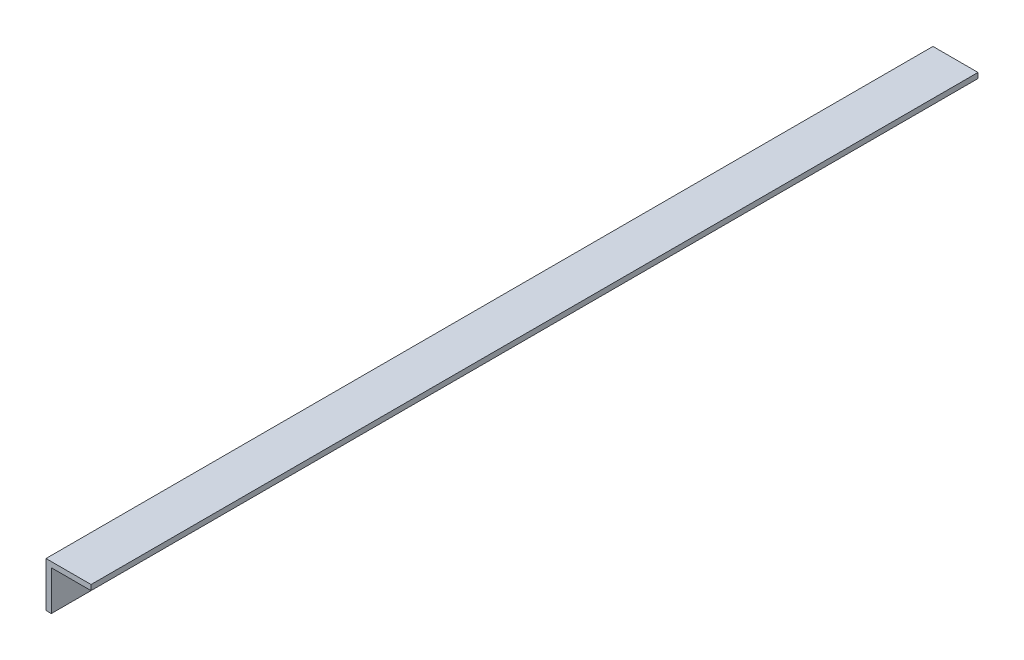
ISO-10303-21;
HEADER;
FILE_DESCRIPTION(('STEP AP214'),'2;1');
FILE_NAME('part.step','',(''),(''),'','','');
FILE_SCHEMA(('AUTOMOTIVE_DESIGN { 1 0 10303 214 1 1 1 1 }'));
ENDSEC;
DATA;
#1=APPLICATION_CONTEXT('core data for automotive mechanical design processes');
#2=APPLICATION_PROTOCOL_DEFINITION('international standard','automotive_design',2000,#1);
#3=PRODUCT_CONTEXT('',#1,'mechanical');
#4=PRODUCT('Part','Part','',(#3));
#5=PRODUCT_RELATED_PRODUCT_CATEGORY('part','',(#4));
#6=PRODUCT_DEFINITION_FORMATION('','',#4);
#7=PRODUCT_DEFINITION_CONTEXT('part definition',#1,'design');
#8=PRODUCT_DEFINITION('design','',#6,#7);
#9=PRODUCT_DEFINITION_SHAPE('','',#8);
#10=(LENGTH_UNIT() NAMED_UNIT(*) SI_UNIT(.MILLI.,.METRE.));
#11=(NAMED_UNIT(*) PLANE_ANGLE_UNIT() SI_UNIT($,.RADIAN.));
#12=(NAMED_UNIT(*) SI_UNIT($,.STERADIAN.) SOLID_ANGLE_UNIT());
#13=UNCERTAINTY_MEASURE_WITH_UNIT(LENGTH_MEASURE(1.E-05),#10,'distance_accuracy_value','');
#14=(GEOMETRIC_REPRESENTATION_CONTEXT(3) GLOBAL_UNCERTAINTY_ASSIGNED_CONTEXT((#13)) GLOBAL_UNIT_ASSIGNED_CONTEXT((#10,
#11,#12)) REPRESENTATION_CONTEXT('',''));
#15=CARTESIAN_POINT('',(0.,0.,0.));
#16=DIRECTION('',(0.,0.,1.));
#17=DIRECTION('',(1.,0.,0.));
#18=AXIS2_PLACEMENT_3D('',#15,#16,#17);
#19=CARTESIAN_POINT('',(0.,0.,500.));
#20=DIRECTION('',(0.,-1.,0.));
#21=DIRECTION('',(0.,0.,-1.));
#22=AXIS2_PLACEMENT_3D('',#19,#20,#21);
#23=PLANE('',#22);
#24=DIRECTION('',(-1.,0.,0.));
#25=VECTOR('',#24,1.);
#26=CARTESIAN_POINT('',(0.,0.,0.));
#27=LINE('',#26,#25);
#28=CARTESIAN_POINT('',(25.4,0.,0.));
#29=VERTEX_POINT('',#28);
#30=CARTESIAN_POINT('',(0.,0.,0.));
#31=VERTEX_POINT('',#30);
#32=EDGE_CURVE('E134',#29,#31,#27,.T.);
#33=ORIENTED_EDGE('',*,*,#32,.T.);
#34=DIRECTION('',(0.,0.,-1.));
#35=VECTOR('',#34,1.);
#36=CARTESIAN_POINT('',(0.,0.,500.));
#37=LINE('',#36,#35);
#38=CARTESIAN_POINT('',(0.,0.,500.));
#39=VERTEX_POINT('',#38);
#40=EDGE_CURVE('E11',#39,#31,#37,.T.);
#41=ORIENTED_EDGE('',*,*,#40,.F.);
#42=DIRECTION('',(-1.,0.,0.));
#43=VECTOR('',#42,1.);
#44=CARTESIAN_POINT('',(0.,0.,500.));
#45=LINE('',#44,#43);
#46=CARTESIAN_POINT('',(25.4,0.,500.));
#47=VERTEX_POINT('',#46);
#48=EDGE_CURVE('E150',#47,#39,#45,.T.);
#49=ORIENTED_EDGE('',*,*,#48,.F.);
#50=DIRECTION('',(0.,0.,-1.));
#51=VECTOR('',#50,1.);
#52=CARTESIAN_POINT('',(25.4,0.,500.));
#53=LINE('',#52,#51);
#54=EDGE_CURVE('E130',#47,#29,#53,.T.);
#55=ORIENTED_EDGE('',*,*,#54,.T.);
#56=EDGE_LOOP('',(#33,#41,#49,#55));
#57=FACE_BOUND('',#56,.T.);
#58=ADVANCED_FACE('F45',(#57),#23,.F.);
#59=CARTESIAN_POINT('',(0.,0.,500.));
#60=DIRECTION('',(1.,0.,0.));
#61=DIRECTION('',(0.,0.,-1.));
#62=AXIS2_PLACEMENT_3D('',#59,#60,#61);
#63=PLANE('',#62);
#64=DIRECTION('',(0.,-1.,0.));
#65=VECTOR('',#64,1.);
#66=CARTESIAN_POINT('',(0.,0.,0.));
#67=LINE('',#66,#65);
#68=CARTESIAN_POINT('',(0.,-25.4,0.));
#69=VERTEX_POINT('',#68);
#70=EDGE_CURVE('E138',#31,#69,#67,.T.);
#71=ORIENTED_EDGE('',*,*,#70,.T.);
#72=DIRECTION('',(0.,0.,-1.));
#73=VECTOR('',#72,1.);
#74=CARTESIAN_POINT('',(0.,-25.4,500.));
#75=LINE('',#74,#73);
#76=CARTESIAN_POINT('',(0.,-25.4,500.));
#77=VERTEX_POINT('',#76);
#78=EDGE_CURVE('E54',#77,#69,#75,.T.);
#79=ORIENTED_EDGE('',*,*,#78,.F.);
#80=DIRECTION('',(0.,-1.,0.));
#81=VECTOR('',#80,1.);
#82=CARTESIAN_POINT('',(0.,0.,500.));
#83=LINE('',#82,#81);
#84=EDGE_CURVE('E99',#39,#77,#83,.T.);
#85=ORIENTED_EDGE('',*,*,#84,.F.);
#86=ORIENTED_EDGE('',*,*,#40,.T.);
#87=EDGE_LOOP('',(#71,#79,#85,#86));
#88=FACE_BOUND('',#87,.T.);
#89=ADVANCED_FACE('F178',(#88),#63,.F.);
#90=CARTESIAN_POINT('',(0.,-25.4,500.));
#91=DIRECTION('',(0.,1.,0.));
#92=DIRECTION('',(0.,0.,1.));
#93=AXIS2_PLACEMENT_3D('',#90,#91,#92);
#94=PLANE('',#93);
#95=DIRECTION('',(1.,0.,0.));
#96=VECTOR('',#95,1.);
#97=CARTESIAN_POINT('',(0.,-25.4,0.));
#98=LINE('',#97,#96);
#99=CARTESIAN_POINT('',(3.,-25.4,0.));
#100=VERTEX_POINT('',#99);
#101=EDGE_CURVE('E141',#69,#100,#98,.T.);
#102=ORIENTED_EDGE('',*,*,#101,.T.);
#103=DIRECTION('',(0.,0.,-1.));
#104=VECTOR('',#103,1.);
#105=CARTESIAN_POINT('',(3.,-25.4,500.));
#106=LINE('',#105,#104);
#107=CARTESIAN_POINT('',(3.,-25.4,500.));
#108=VERTEX_POINT('',#107);
#109=EDGE_CURVE('E123',#108,#100,#106,.T.);
#110=ORIENTED_EDGE('',*,*,#109,.F.);
#111=DIRECTION('',(1.,0.,0.));
#112=VECTOR('',#111,1.);
#113=CARTESIAN_POINT('',(0.,-25.4,500.));
#114=LINE('',#113,#112);
#115=EDGE_CURVE('E112',#77,#108,#114,.T.);
#116=ORIENTED_EDGE('',*,*,#115,.F.);
#117=ORIENTED_EDGE('',*,*,#78,.T.);
#118=EDGE_LOOP('',(#102,#110,#116,#117));
#119=FACE_BOUND('',#118,.T.);
#120=ADVANCED_FACE('F160',(#119),#94,.F.);
#121=CARTESIAN_POINT('',(3.,-3.,500.));
#122=DIRECTION('',(-1.,0.,0.));
#123=DIRECTION('',(0.,0.,1.));
#124=AXIS2_PLACEMENT_3D('',#121,#122,#123);
#125=PLANE('',#124);
#126=DIRECTION('',(0.,1.,0.));
#127=VECTOR('',#126,1.);
#128=CARTESIAN_POINT('',(3.,-3.,0.));
#129=LINE('',#128,#127);
#130=CARTESIAN_POINT('',(3.,-3.,0.));
#131=VERTEX_POINT('',#130);
#132=EDGE_CURVE('E121',#100,#131,#129,.T.);
#133=ORIENTED_EDGE('',*,*,#132,.T.);
#134=DIRECTION('',(0.,0.,-1.));
#135=VECTOR('',#134,1.);
#136=CARTESIAN_POINT('',(3.,-3.,500.));
#137=LINE('',#136,#135);
#138=CARTESIAN_POINT('',(3.,-3.,500.));
#139=VERTEX_POINT('',#138);
#140=EDGE_CURVE('E118',#139,#131,#137,.T.);
#141=ORIENTED_EDGE('',*,*,#140,.F.);
#142=DIRECTION('',(0.,1.,0.));
#143=VECTOR('',#142,1.);
#144=CARTESIAN_POINT('',(3.,-3.,500.));
#145=LINE('',#144,#143);
#146=EDGE_CURVE('E106',#108,#139,#145,.T.);
#147=ORIENTED_EDGE('',*,*,#146,.F.);
#148=ORIENTED_EDGE('',*,*,#109,.T.);
#149=EDGE_LOOP('',(#133,#141,#147,#148));
#150=FACE_BOUND('',#149,.T.);
#151=ADVANCED_FACE('F119',(#150),#125,.F.);
#152=CARTESIAN_POINT('',(3.,-3.,500.));
#153=DIRECTION('',(0.,1.,0.));
#154=DIRECTION('',(0.,0.,1.));
#155=AXIS2_PLACEMENT_3D('',#152,#153,#154);
#156=PLANE('',#155);
#157=DIRECTION('',(1.,0.,0.));
#158=VECTOR('',#157,1.);
#159=CARTESIAN_POINT('',(3.,-3.,0.));
#160=LINE('',#159,#158);
#161=CARTESIAN_POINT('',(25.4,-3.,0.));
#162=VERTEX_POINT('',#161);
#163=EDGE_CURVE('E85',#131,#162,#160,.T.);
#164=ORIENTED_EDGE('',*,*,#163,.T.);
#165=DIRECTION('',(0.,0.,-1.));
#166=VECTOR('',#165,1.);
#167=CARTESIAN_POINT('',(25.4,-3.,500.));
#168=LINE('',#167,#166);
#169=CARTESIAN_POINT('',(25.4,-3.,500.));
#170=VERTEX_POINT('',#169);
#171=EDGE_CURVE('E124',#170,#162,#168,.T.);
#172=ORIENTED_EDGE('',*,*,#171,.F.);
#173=DIRECTION('',(1.,0.,0.));
#174=VECTOR('',#173,1.);
#175=CARTESIAN_POINT('',(3.,-3.,500.));
#176=LINE('',#175,#174);
#177=EDGE_CURVE('E110',#139,#170,#176,.T.);
#178=ORIENTED_EDGE('',*,*,#177,.F.);
#179=ORIENTED_EDGE('',*,*,#140,.T.);
#180=EDGE_LOOP('',(#164,#172,#178,#179));
#181=FACE_BOUND('',#180,.T.);
#182=ADVANCED_FACE('F126',(#181),#156,.F.);
#183=CARTESIAN_POINT('',(25.4,0.,500.));
#184=DIRECTION('',(-1.,0.,0.));
#185=DIRECTION('',(0.,0.,1.));
#186=AXIS2_PLACEMENT_3D('',#183,#184,#185);
#187=PLANE('',#186);
#188=DIRECTION('',(0.,1.,0.));
#189=VECTOR('',#188,1.);
#190=CARTESIAN_POINT('',(25.4,0.,0.));
#191=LINE('',#190,#189);
#192=EDGE_CURVE('E91',#162,#29,#191,.T.);
#193=ORIENTED_EDGE('',*,*,#192,.T.);
#194=ORIENTED_EDGE('',*,*,#54,.F.);
#195=DIRECTION('',(0.,1.,0.));
#196=VECTOR('',#195,1.);
#197=CARTESIAN_POINT('',(25.4,0.,500.));
#198=LINE('',#197,#196);
#199=EDGE_CURVE('E62',#170,#47,#198,.T.);
#200=ORIENTED_EDGE('',*,*,#199,.F.);
#201=ORIENTED_EDGE('',*,*,#171,.T.);
#202=EDGE_LOOP('',(#193,#194,#200,#201));
#203=FACE_BOUND('',#202,.T.);
#204=ADVANCED_FACE('F167',(#203),#187,.F.);
#205=CARTESIAN_POINT('',(0.,0.,500.));
#206=DIRECTION('',(0.,0.,-1.));
#207=DIRECTION('',(-1.,0.,0.));
#208=AXIS2_PLACEMENT_3D('',#205,#206,#207);
#209=PLANE('',#208);
#210=ORIENTED_EDGE('',*,*,#48,.T.);
#211=ORIENTED_EDGE('',*,*,#84,.T.);
#212=ORIENTED_EDGE('',*,*,#115,.T.);
#213=ORIENTED_EDGE('',*,*,#146,.T.);
#214=ORIENTED_EDGE('',*,*,#177,.T.);
#215=ORIENTED_EDGE('',*,*,#199,.T.);
#216=EDGE_LOOP('',(#210,#211,#212,#213,#214,#215));
#217=FACE_BOUND('',#216,.T.);
#218=ADVANCED_FACE('F108',(#217),#209,.F.);
#219=CARTESIAN_POINT('',(0.,0.,0.));
#220=DIRECTION('',(0.,0.,-1.));
#221=DIRECTION('',(-1.,0.,0.));
#222=AXIS2_PLACEMENT_3D('',#219,#220,#221);
#223=PLANE('',#222);
#224=ORIENTED_EDGE('',*,*,#32,.F.);
#225=ORIENTED_EDGE('',*,*,#192,.F.);
#226=ORIENTED_EDGE('',*,*,#163,.F.);
#227=ORIENTED_EDGE('',*,*,#132,.F.);
#228=ORIENTED_EDGE('',*,*,#101,.F.);
#229=ORIENTED_EDGE('',*,*,#70,.F.);
#230=EDGE_LOOP('',(#224,#225,#226,#227,#228,#229));
#231=FACE_BOUND('',#230,.T.);
#232=ADVANCED_FACE('F163',(#231),#223,.T.);
#233=CLOSED_SHELL('',(#58,#89,#120,#151,#182,#204,#218,#232));
#234=MANIFOLD_SOLID_BREP('B2',#233);
#235=ADVANCED_BREP_SHAPE_REPRESENTATION('',(#18,#234),#14);
#236=SHAPE_DEFINITION_REPRESENTATION(#9,#235);
ENDSEC;
END-ISO-10303-21;
